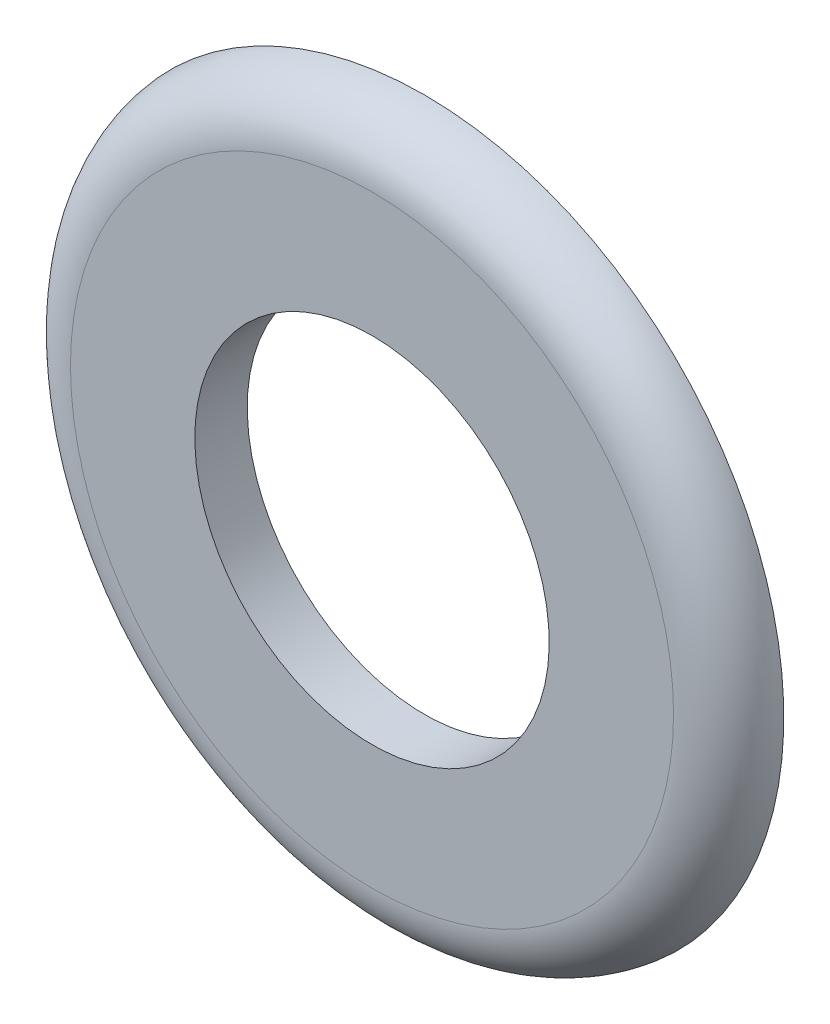
ISO-10303-21;
HEADER;
FILE_DESCRIPTION(('STEP AP214'),'2;1');
FILE_NAME('part.step','',(''),(''),'','','');
FILE_SCHEMA(('AUTOMOTIVE_DESIGN { 1 0 10303 214 1 1 1 1 }'));
ENDSEC;
DATA;
#1=APPLICATION_CONTEXT('core data for automotive mechanical design processes');
#2=APPLICATION_PROTOCOL_DEFINITION('international standard','automotive_design',2000,#1);
#3=PRODUCT_CONTEXT('',#1,'mechanical');
#4=PRODUCT('Part','Part','',(#3));
#5=PRODUCT_RELATED_PRODUCT_CATEGORY('part','',(#4));
#6=PRODUCT_DEFINITION_FORMATION('','',#4);
#7=PRODUCT_DEFINITION_CONTEXT('part definition',#1,'design');
#8=PRODUCT_DEFINITION('design','',#6,#7);
#9=PRODUCT_DEFINITION_SHAPE('','',#8);
#10=(LENGTH_UNIT() NAMED_UNIT(*) SI_UNIT(.MILLI.,.METRE.));
#11=(NAMED_UNIT(*) PLANE_ANGLE_UNIT() SI_UNIT($,.RADIAN.));
#12=(NAMED_UNIT(*) SI_UNIT($,.STERADIAN.) SOLID_ANGLE_UNIT());
#13=UNCERTAINTY_MEASURE_WITH_UNIT(LENGTH_MEASURE(1.E-05),#10,'distance_accuracy_value','');
#14=(GEOMETRIC_REPRESENTATION_CONTEXT(3) GLOBAL_UNCERTAINTY_ASSIGNED_CONTEXT((#13)) GLOBAL_UNIT_ASSIGNED_CONTEXT((#10,
#11,#12)) REPRESENTATION_CONTEXT('',''));
#15=CARTESIAN_POINT('',(0.,0.,0.));
#16=DIRECTION('',(0.,0.,1.));
#17=DIRECTION('',(1.,0.,0.));
#18=AXIS2_PLACEMENT_3D('',#15,#16,#17);
#19=CARTESIAN_POINT('',(0.,4.,5.7714));
#20=DIRECTION('',(0.,0.,1.));
#21=DIRECTION('',(0.,-1.,0.));
#22=AXIS2_PLACEMENT_3D('',#19,#20,#21);
#23=PLANE('',#22);
#24=CARTESIAN_POINT('',(0.,0.,5.7714));
#25=DIRECTION('',(0.,0.,-1.));
#26=DIRECTION('',(0.,1.,0.));
#27=AXIS2_PLACEMENT_3D('',#24,#25,#26);
#28=CIRCLE('',#27,2.35048094716167);
#29=CARTESIAN_POINT('',(0.,2.35048094716167,5.7714));
#30=VERTEX_POINT('',#29);
#31=EDGE_CURVE('E20',#30,#30,#28,.T.);
#32=ORIENTED_EDGE('',*,*,#31,.T.);
#33=EDGE_LOOP('',(#32));
#34=FACE_BOUND('',#33,.T.);
#35=CARTESIAN_POINT('',(0.,0.,5.7714));
#36=DIRECTION('',(0.,0.,-1.));
#37=DIRECTION('',(0.,1.,0.));
#38=AXIS2_PLACEMENT_3D('',#35,#36,#37);
#39=CIRCLE('',#38,4.);
#40=CARTESIAN_POINT('',(0.,4.,5.7714));
#41=VERTEX_POINT('',#40);
#42=CARTESIAN_POINT('',(0.,-4.,5.7714));
#43=VERTEX_POINT('',#42);
#44=EDGE_CURVE('E32',#41,#43,#39,.T.);
#45=ORIENTED_EDGE('',*,*,#44,.F.);
#46=CARTESIAN_POINT('',(0.,0.,5.7714));
#47=DIRECTION('',(0.,0.,-1.));
#48=DIRECTION('',(0.,-1.,0.));
#49=AXIS2_PLACEMENT_3D('',#46,#47,#48);
#50=CIRCLE('',#49,4.);
#51=EDGE_CURVE('E35',#43,#41,#50,.T.);
#52=ORIENTED_EDGE('',*,*,#51,.F.);
#53=EDGE_LOOP('',(#45,#52));
#54=FACE_BOUND('',#53,.T.);
#55=ADVANCED_FACE('F16',(#34,#54),#23,.T.);
#56=CARTESIAN_POINT('',(0.,0.,5.));
#57=DIRECTION('',(0.,0.,-1.));
#58=DIRECTION('',(0.,1.,0.));
#59=AXIS2_PLACEMENT_3D('',#56,#57,#58);
#60=TOROIDAL_SURFACE('',#59,4.,0.771399999999999);
#61=ORIENTED_EDGE('',*,*,#44,.T.);
#62=ORIENTED_EDGE('',*,*,#51,.T.);
#63=EDGE_LOOP('',(#61,#62));
#64=FACE_BOUND('',#63,.T.);
#65=CARTESIAN_POINT('',(0.,0.,5.0762));
#66=DIRECTION('',(0.,0.,-1.));
#67=DIRECTION('',(0.,1.,0.));
#68=AXIS2_PLACEMENT_3D('',#65,#66,#67);
#69=CIRCLE('',#68,4.76762720118557);
#70=CARTESIAN_POINT('',(0.,4.76762720118557,5.0762));
#71=VERTEX_POINT('',#70);
#72=EDGE_CURVE('E26',#71,#71,#69,.T.);
#73=ORIENTED_EDGE('',*,*,#72,.F.);
#74=EDGE_LOOP('',(#73));
#75=FACE_BOUND('',#74,.T.);
#76=ADVANCED_FACE('F42',(#64,#75),#60,.T.);
#77=CARTESIAN_POINT('',(0.,0.,5.0762));
#78=DIRECTION('',(0.,0.,-1.));
#79=DIRECTION('',(0.,1.,0.));
#80=AXIS2_PLACEMENT_3D('',#77,#78,#79);
#81=CYLINDRICAL_SURFACE('',#80,2.35048094716167);
#82=CARTESIAN_POINT('',(0.,0.,5.0762));
#83=DIRECTION('',(0.,0.,-1.));
#84=DIRECTION('',(0.,1.,0.));
#85=AXIS2_PLACEMENT_3D('',#82,#83,#84);
#86=CIRCLE('',#85,2.35048094716167);
#87=CARTESIAN_POINT('',(0.,2.35048094716167,5.0762));
#88=VERTEX_POINT('',#87);
#89=EDGE_CURVE('E11',#88,#88,#86,.F.);
#90=ORIENTED_EDGE('',*,*,#89,.F.);
#91=EDGE_LOOP('',(#90));
#92=FACE_BOUND('',#91,.T.);
#93=ORIENTED_EDGE('',*,*,#31,.F.);
#94=EDGE_LOOP('',(#93));
#95=FACE_BOUND('',#94,.T.);
#96=ADVANCED_FACE('F59',(#92,#95),#81,.F.);
#97=CARTESIAN_POINT('',(0.,2.35048094716167,5.0762));
#98=DIRECTION('',(0.,0.,-1.));
#99=DIRECTION('',(0.,1.,0.));
#100=AXIS2_PLACEMENT_3D('',#97,#98,#99);
#101=PLANE('',#100);
#102=ORIENTED_EDGE('',*,*,#89,.T.);
#103=EDGE_LOOP('',(#102));
#104=FACE_BOUND('',#103,.T.);
#105=ORIENTED_EDGE('',*,*,#72,.T.);
#106=EDGE_LOOP('',(#105));
#107=FACE_BOUND('',#106,.T.);
#108=ADVANCED_FACE('F85',(#104,#107),#101,.T.);
#109=CLOSED_SHELL('',(#55,#76,#96,#108));
#110=MANIFOLD_SOLID_BREP('B1',#109);
#111=ADVANCED_BREP_SHAPE_REPRESENTATION('',(#18,#110),#14);
#112=SHAPE_DEFINITION_REPRESENTATION(#9,#111);
ENDSEC;
END-ISO-10303-21;
